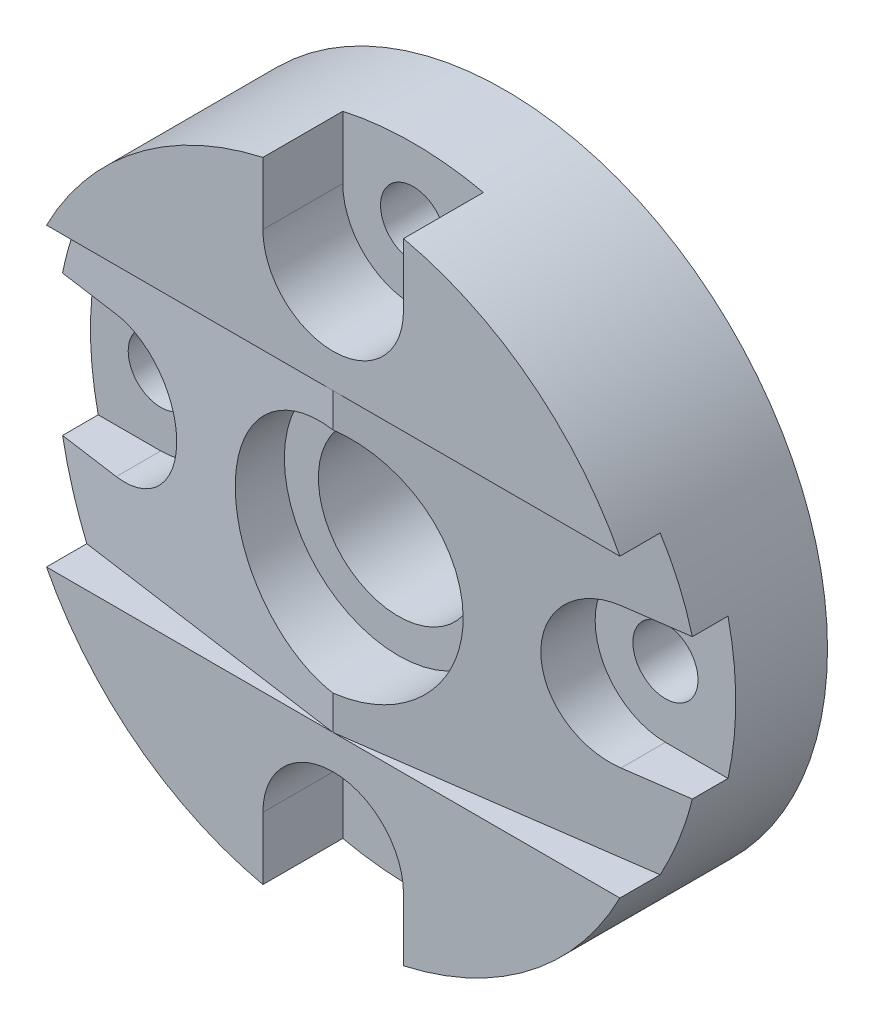
ISO-10303-21;
HEADER;
FILE_DESCRIPTION(('STEP AP214'),'2;1');
FILE_NAME('part.step','',(''),(''),'','','');
FILE_SCHEMA(('AUTOMOTIVE_DESIGN { 1 0 10303 214 1 1 1 1 }'));
ENDSEC;
DATA;
#1=APPLICATION_CONTEXT('core data for automotive mechanical design processes');
#2=APPLICATION_PROTOCOL_DEFINITION('international standard','automotive_design',2000,#1);
#3=PRODUCT_CONTEXT('',#1,'mechanical');
#4=PRODUCT('Part','Part','',(#3));
#5=PRODUCT_RELATED_PRODUCT_CATEGORY('part','',(#4));
#6=PRODUCT_DEFINITION_FORMATION('','',#4);
#7=PRODUCT_DEFINITION_CONTEXT('part definition',#1,'design');
#8=PRODUCT_DEFINITION('design','',#6,#7);
#9=PRODUCT_DEFINITION_SHAPE('','',#8);
#10=(LENGTH_UNIT() NAMED_UNIT(*) SI_UNIT(.MILLI.,.METRE.));
#11=(NAMED_UNIT(*) PLANE_ANGLE_UNIT() SI_UNIT($,.RADIAN.));
#12=(NAMED_UNIT(*) SI_UNIT($,.STERADIAN.) SOLID_ANGLE_UNIT());
#13=UNCERTAINTY_MEASURE_WITH_UNIT(LENGTH_MEASURE(1.E-05),#10,'distance_accuracy_value','');
#14=(GEOMETRIC_REPRESENTATION_CONTEXT(3) GLOBAL_UNCERTAINTY_ASSIGNED_CONTEXT((#13)) GLOBAL_UNIT_ASSIGNED_CONTEXT((#10,
#11,#12)) REPRESENTATION_CONTEXT('',''));
#15=CARTESIAN_POINT('',(0.,0.,0.));
#16=DIRECTION('',(0.,0.,1.));
#17=DIRECTION('',(1.,0.,0.));
#18=AXIS2_PLACEMENT_3D('',#15,#16,#17);
#19=CARTESIAN_POINT('',(0.,0.,0.));
#20=DIRECTION('',(0.,0.,1.));
#21=DIRECTION('',(1.,0.,0.));
#22=AXIS2_PLACEMENT_3D('',#19,#20,#21);
#23=PLANE('',#22);
#24=CARTESIAN_POINT('',(-3.02411339839128E-13,-43.307,0.));
#25=DIRECTION('',(0.,0.,1.));
#26=DIRECTION('',(-1.,0.,0.));
#27=AXIS2_PLACEMENT_3D('',#24,#25,#26);
#28=CIRCLE('',#27,5.588);
#29=CARTESIAN_POINT('',(-5.5880000000003,-43.307,0.));
#30=VERTEX_POINT('',#29);
#31=EDGE_CURVE('E381',#30,#30,#28,.T.);
#32=ORIENTED_EDGE('',*,*,#31,.T.);
#33=EDGE_LOOP('',(#32));
#34=FACE_BOUND('',#33,.T.);
#35=CARTESIAN_POINT('',(0.,43.307,0.));
#36=DIRECTION('',(0.,0.,1.));
#37=DIRECTION('',(1.,0.,0.));
#38=AXIS2_PLACEMENT_3D('',#35,#36,#37);
#39=CIRCLE('',#38,5.588);
#40=CARTESIAN_POINT('',(5.588,43.307,0.));
#41=VERTEX_POINT('',#40);
#42=EDGE_CURVE('E257',#41,#41,#39,.T.);
#43=ORIENTED_EDGE('',*,*,#42,.T.);
#44=EDGE_LOOP('',(#43));
#45=FACE_BOUND('',#44,.T.);
#46=CARTESIAN_POINT('',(0.,0.,0.));
#47=DIRECTION('',(0.,0.,1.));
#48=DIRECTION('',(1.,0.,0.));
#49=AXIS2_PLACEMENT_3D('',#46,#47,#48);
#50=CIRCLE('',#49,13.716);
#51=CARTESIAN_POINT('',(13.716,0.,0.));
#52=VERTEX_POINT('',#51);
#53=EDGE_CURVE('E340',#52,#52,#50,.T.);
#54=ORIENTED_EDGE('',*,*,#53,.T.);
#55=EDGE_LOOP('',(#54));
#56=FACE_BOUND('',#55,.T.);
#57=CARTESIAN_POINT('',(0.,0.,0.));
#58=DIRECTION('',(0.,0.,1.));
#59=DIRECTION('',(1.,0.,0.));
#60=AXIS2_PLACEMENT_3D('',#57,#58,#59);
#61=CIRCLE('',#60,55.372);
#62=CARTESIAN_POINT('',(55.372,0.,0.));
#63=VERTEX_POINT('',#62);
#64=EDGE_CURVE('E343',#63,#63,#61,.T.);
#65=ORIENTED_EDGE('',*,*,#64,.F.);
#66=EDGE_LOOP('',(#65));
#67=FACE_BOUND('',#66,.T.);
#68=CARTESIAN_POINT('',(43.307,-1.51205669919564E-13,0.));
#69=DIRECTION('',(0.,0.,1.));
#70=DIRECTION('',(0.,-1.,0.));
#71=AXIS2_PLACEMENT_3D('',#68,#69,#70);
#72=CIRCLE('',#71,5.588);
#73=CARTESIAN_POINT('',(43.307,-5.58800000000015,0.));
#74=VERTEX_POINT('',#73);
#75=EDGE_CURVE('E207',#74,#74,#72,.T.);
#76=ORIENTED_EDGE('',*,*,#75,.T.);
#77=EDGE_LOOP('',(#76));
#78=FACE_BOUND('',#77,.T.);
#79=CARTESIAN_POINT('',(-43.307,4.53617009758692E-13,0.));
#80=DIRECTION('',(0.,0.,1.));
#81=DIRECTION('',(0.,1.,0.));
#82=AXIS2_PLACEMENT_3D('',#79,#80,#81);
#83=CIRCLE('',#82,5.588);
#84=CARTESIAN_POINT('',(-43.3069999999999,5.58800000000045,0.));
#85=VERTEX_POINT('',#84);
#86=EDGE_CURVE('E389',#85,#85,#83,.T.);
#87=ORIENTED_EDGE('',*,*,#86,.T.);
#88=EDGE_LOOP('',(#87));
#89=FACE_BOUND('',#88,.T.);
#90=ADVANCED_FACE('F31',(#34,#45,#56,#67,#78,#89),#23,.F.);
#91=CARTESIAN_POINT('',(-43.307,4.53617009758692E-13,15.748));
#92=DIRECTION('',(0.,0.,-1.));
#93=DIRECTION('',(0.,-1.,0.));
#94=AXIS2_PLACEMENT_3D('',#91,#92,#93);
#95=PLANE('',#94);
#96=DIRECTION('',(-1.,0.,0.));
#97=VECTOR('',#96,1.);
#98=CARTESIAN_POINT('',(-43.3070000000001,-12.0649999999995,15.748));
#99=LINE('',#98,#97);
#100=CARTESIAN_POINT('',(-43.3070000000001,-12.0649999999995,15.748));
#101=VERTEX_POINT('',#100);
#102=CARTESIAN_POINT('',(-54.041596562278,-12.0649999999994,15.748));
#103=VERTEX_POINT('',#102);
#104=EDGE_CURVE('E186',#101,#103,#99,.T.);
#105=ORIENTED_EDGE('',*,*,#104,.F.);
#106=CARTESIAN_POINT('',(-43.307,4.53617009758692E-13,15.748));
#107=DIRECTION('',(0.,0.,-1.));
#108=DIRECTION('',(0.,-1.,0.));
#109=AXIS2_PLACEMENT_3D('',#106,#107,#108);
#110=CIRCLE('',#109,12.065);
#111=CARTESIAN_POINT('',(-43.3069999999999,12.0650000000005,15.748));
#112=VERTEX_POINT('',#111);
#113=EDGE_CURVE('E199',#112,#101,#110,.T.);
#114=ORIENTED_EDGE('',*,*,#113,.F.);
#115=DIRECTION('',(-1.,0.,0.));
#116=VECTOR('',#115,1.);
#117=CARTESIAN_POINT('',(-43.3069999999999,12.0650000000005,15.748));
#118=LINE('',#117,#116);
#119=CARTESIAN_POINT('',(-54.0415965622777,12.0650000000006,15.748));
#120=VERTEX_POINT('',#119);
#121=EDGE_CURVE('E192',#112,#120,#118,.T.);
#122=ORIENTED_EDGE('',*,*,#121,.T.);
#123=CARTESIAN_POINT('',(0.,0.,15.748));
#124=DIRECTION('',(0.,0.,-1.));
#125=DIRECTION('',(-1.,0.,0.));
#126=AXIS2_PLACEMENT_3D('',#123,#124,#125);
#127=CIRCLE('',#126,55.372);
#128=EDGE_CURVE('E11',#103,#120,#127,.T.);
#129=ORIENTED_EDGE('',*,*,#128,.F.);
#130=EDGE_LOOP('',(#105,#114,#122,#129));
#131=FACE_BOUND('',#130,.T.);
#132=CARTESIAN_POINT('',(-43.307,4.53617009758692E-13,15.748));
#133=DIRECTION('',(0.,0.,-1.));
#134=DIRECTION('',(-1.,0.,0.));
#135=AXIS2_PLACEMENT_3D('',#132,#133,#134);
#136=CIRCLE('',#135,5.588);
#137=CARTESIAN_POINT('',(-48.895,4.53617009758692E-13,15.748));
#138=VERTEX_POINT('',#137);
#139=EDGE_CURVE('E35',#138,#138,#136,.F.);
#140=ORIENTED_EDGE('',*,*,#139,.F.);
#141=EDGE_LOOP('',(#140));
#142=FACE_BOUND('',#141,.T.);
#143=ADVANCED_FACE('F196',(#131,#142),#95,.F.);
#144=CARTESIAN_POINT('',(-3.02411339839128E-13,-43.307,15.748));
#145=DIRECTION('',(0.,0.,-1.));
#146=DIRECTION('',(1.,0.,0.));
#147=AXIS2_PLACEMENT_3D('',#144,#145,#146);
#148=PLANE('',#147);
#149=DIRECTION('',(0.,-1.,0.));
#150=VECTOR('',#149,1.);
#151=CARTESIAN_POINT('',(12.0649999999997,-43.3070000000001,15.748));
#152=LINE('',#151,#150);
#153=CARTESIAN_POINT('',(12.0649999999997,-43.3070000000001,15.748));
#154=VERTEX_POINT('',#153);
#155=CARTESIAN_POINT('',(12.0649999999996,-54.0415965622779,15.748));
#156=VERTEX_POINT('',#155);
#157=EDGE_CURVE('E220',#154,#156,#152,.T.);
#158=ORIENTED_EDGE('',*,*,#157,.F.);
#159=CARTESIAN_POINT('',(-3.02411339839128E-13,-43.307,15.748));
#160=DIRECTION('',(0.,0.,-1.));
#161=DIRECTION('',(1.,0.,0.));
#162=AXIS2_PLACEMENT_3D('',#159,#160,#161);
#163=CIRCLE('',#162,12.065);
#164=CARTESIAN_POINT('',(-12.0650000000003,-43.3069999999999,15.748));
#165=VERTEX_POINT('',#164);
#166=EDGE_CURVE('E217',#165,#154,#163,.T.);
#167=ORIENTED_EDGE('',*,*,#166,.F.);
#168=DIRECTION('',(0.,-1.,0.));
#169=VECTOR('',#168,1.);
#170=CARTESIAN_POINT('',(-12.0650000000003,-43.3069999999999,15.748));
#171=LINE('',#170,#169);
#172=CARTESIAN_POINT('',(-12.0650000000004,-54.0415965622778,15.748));
#173=VERTEX_POINT('',#172);
#174=EDGE_CURVE('E222',#165,#173,#171,.T.);
#175=ORIENTED_EDGE('',*,*,#174,.T.);
#176=CARTESIAN_POINT('',(0.,0.,15.748));
#177=DIRECTION('',(0.,0.,-1.));
#178=DIRECTION('',(-1.,0.,0.));
#179=AXIS2_PLACEMENT_3D('',#176,#177,#178);
#180=CIRCLE('',#179,55.372);
#181=EDGE_CURVE('E372',#156,#173,#180,.T.);
#182=ORIENTED_EDGE('',*,*,#181,.F.);
#183=EDGE_LOOP('',(#158,#167,#175,#182));
#184=FACE_BOUND('',#183,.T.);
#185=CARTESIAN_POINT('',(-3.02411339839128E-13,-43.307,15.748));
#186=DIRECTION('',(0.,0.,-1.));
#187=DIRECTION('',(-1.,0.,0.));
#188=AXIS2_PLACEMENT_3D('',#185,#186,#187);
#189=CIRCLE('',#188,5.588);
#190=CARTESIAN_POINT('',(-5.5880000000003,-43.307,15.748));
#191=VERTEX_POINT('',#190);
#192=EDGE_CURVE('E379',#191,#191,#189,.F.);
#193=ORIENTED_EDGE('',*,*,#192,.F.);
#194=EDGE_LOOP('',(#193));
#195=FACE_BOUND('',#194,.T.);
#196=ADVANCED_FACE('F402',(#184,#195),#148,.F.);
#197=CARTESIAN_POINT('',(43.307,-1.51205669919564E-13,15.748));
#198=DIRECTION('',(0.,0.,-1.));
#199=DIRECTION('',(0.,1.,0.));
#200=AXIS2_PLACEMENT_3D('',#197,#198,#199);
#201=PLANE('',#200);
#202=DIRECTION('',(1.,0.,0.));
#203=VECTOR('',#202,1.);
#204=CARTESIAN_POINT('',(43.307,12.0649999999998,15.748));
#205=LINE('',#204,#203);
#206=CARTESIAN_POINT('',(43.307,12.0649999999998,15.748));
#207=VERTEX_POINT('',#206);
#208=CARTESIAN_POINT('',(54.0415965622779,12.0649999999998,15.748));
#209=VERTEX_POINT('',#208);
#210=EDGE_CURVE('E242',#207,#209,#205,.T.);
#211=ORIENTED_EDGE('',*,*,#210,.F.);
#212=CARTESIAN_POINT('',(43.307,-1.51205669919564E-13,15.748));
#213=DIRECTION('',(0.,0.,-1.));
#214=DIRECTION('',(0.,1.,0.));
#215=AXIS2_PLACEMENT_3D('',#212,#213,#214);
#216=CIRCLE('',#215,12.065);
#217=CARTESIAN_POINT('',(43.307,-12.0650000000002,15.748));
#218=VERTEX_POINT('',#217);
#219=EDGE_CURVE('E239',#218,#207,#216,.T.);
#220=ORIENTED_EDGE('',*,*,#219,.F.);
#221=DIRECTION('',(1.,0.,0.));
#222=VECTOR('',#221,1.);
#223=CARTESIAN_POINT('',(43.307,-12.0650000000002,15.748));
#224=LINE('',#223,#222);
#225=CARTESIAN_POINT('',(54.0415965622778,-12.0650000000002,15.748));
#226=VERTEX_POINT('',#225);
#227=EDGE_CURVE('E245',#218,#226,#224,.T.);
#228=ORIENTED_EDGE('',*,*,#227,.T.);
#229=CARTESIAN_POINT('',(0.,0.,15.748));
#230=DIRECTION('',(0.,0.,-1.));
#231=DIRECTION('',(-1.,0.,0.));
#232=AXIS2_PLACEMENT_3D('',#229,#230,#231);
#233=CIRCLE('',#232,55.372);
#234=EDGE_CURVE('E369',#209,#226,#233,.T.);
#235=ORIENTED_EDGE('',*,*,#234,.F.);
#236=EDGE_LOOP('',(#211,#220,#228,#235));
#237=FACE_BOUND('',#236,.T.);
#238=CARTESIAN_POINT('',(43.307,-1.51205669919564E-13,15.748));
#239=DIRECTION('',(0.,0.,-1.));
#240=DIRECTION('',(-1.,0.,0.));
#241=AXIS2_PLACEMENT_3D('',#238,#239,#240);
#242=CIRCLE('',#241,5.588);
#243=CARTESIAN_POINT('',(37.719,-1.51205669919564E-13,15.748));
#244=VERTEX_POINT('',#243);
#245=EDGE_CURVE('E204',#244,#244,#242,.F.);
#246=ORIENTED_EDGE('',*,*,#245,.F.);
#247=EDGE_LOOP('',(#246));
#248=FACE_BOUND('',#247,.T.);
#249=ADVANCED_FACE('F408',(#237,#248),#201,.F.);
#250=CARTESIAN_POINT('',(0.,0.,29.464));
#251=DIRECTION('',(0.,0.,-1.));
#252=DIRECTION('',(-1.,0.,0.));
#253=AXIS2_PLACEMENT_3D('',#250,#251,#252);
#254=CYLINDRICAL_SURFACE('',#253,55.372);
#255=ORIENTED_EDGE('',*,*,#64,.T.);
#256=EDGE_LOOP('',(#255));
#257=FACE_BOUND('',#256,.T.);
#258=DIRECTION('',(0.,0.,-1.));
#259=VECTOR('',#258,1.);
#260=CARTESIAN_POINT('',(-54.0415965622777,12.0650000000006,29.464));
#261=LINE('',#260,#259);
#262=CARTESIAN_POINT('',(-54.0415965622777,12.0650000000006,21.8689489104876));
#263=VERTEX_POINT('',#262);
#264=EDGE_CURVE('E215',#263,#120,#261,.T.);
#265=ORIENTED_EDGE('',*,*,#264,.F.);
#266=CARTESIAN_POINT('',(0.,0.,29.464));
#267=DIRECTION('',(-0.139173100960066,0.,0.99026806874157));
#268=DIRECTION('',(-0.99026806874157,0.,-0.139173100960066));
#269=AXIS2_PLACEMENT_3D('',#266,#267,#268);
#270=ELLIPSE('',#269,55.9161723455009,55.372);
#271=CARTESIAN_POINT('',(-49.20262578359,25.4,22.5490219028248));
#272=VERTEX_POINT('',#271);
#273=EDGE_CURVE('E299',#272,#263,#270,.T.);
#274=ORIENTED_EDGE('',*,*,#273,.F.);
#275=DIRECTION('',(0.,0.,-1.));
#276=VECTOR('',#275,1.);
#277=CARTESIAN_POINT('',(-49.2026257835901,25.4,29.464));
#278=LINE('',#277,#276);
#279=CARTESIAN_POINT('',(-49.2026257835901,25.4,29.464));
#280=VERTEX_POINT('',#279);
#281=EDGE_CURVE('E304',#272,#280,#278,.F.);
#282=ORIENTED_EDGE('',*,*,#281,.T.);
#283=CARTESIAN_POINT('',(0.,0.,29.464));
#284=DIRECTION('',(0.,0.,1.));
#285=DIRECTION('',(1.,0.,0.));
#286=AXIS2_PLACEMENT_3D('',#283,#284,#285);
#287=CIRCLE('',#286,55.372);
#288=CARTESIAN_POINT('',(-12.065,54.0415965622778,29.464));
#289=VERTEX_POINT('',#288);
#290=EDGE_CURVE('E351',#289,#280,#287,.T.);
#291=ORIENTED_EDGE('',*,*,#290,.F.);
#292=DIRECTION('',(0.,0.,-1.));
#293=VECTOR('',#292,1.);
#294=CARTESIAN_POINT('',(-12.065,54.0415965622778,29.464));
#295=LINE('',#294,#293);
#296=CARTESIAN_POINT('',(-12.065,54.0415965622778,15.748));
#297=VERTEX_POINT('',#296);
#298=EDGE_CURVE('E281',#289,#297,#295,.T.);
#299=ORIENTED_EDGE('',*,*,#298,.T.);
#300=CARTESIAN_POINT('',(0.,0.,15.748));
#301=DIRECTION('',(0.,0.,-1.));
#302=DIRECTION('',(-1.,0.,0.));
#303=AXIS2_PLACEMENT_3D('',#300,#301,#302);
#304=CIRCLE('',#303,55.372);
#305=CARTESIAN_POINT('',(12.065,54.0415965622778,15.748));
#306=VERTEX_POINT('',#305);
#307=EDGE_CURVE('E357',#297,#306,#304,.T.);
#308=ORIENTED_EDGE('',*,*,#307,.T.);
#309=DIRECTION('',(0.,0.,-1.));
#310=VECTOR('',#309,1.);
#311=CARTESIAN_POINT('',(12.065,54.0415965622778,29.464));
#312=LINE('',#311,#310);
#313=CARTESIAN_POINT('',(12.065,54.0415965622778,29.464));
#314=VERTEX_POINT('',#313);
#315=EDGE_CURVE('E285',#314,#306,#312,.T.);
#316=ORIENTED_EDGE('',*,*,#315,.F.);
#317=CARTESIAN_POINT('',(49.2026257835901,25.4,29.464));
#318=VERTEX_POINT('',#317);
#319=EDGE_CURVE('E347',#318,#314,#287,.T.);
#320=ORIENTED_EDGE('',*,*,#319,.F.);
#321=DIRECTION('',(0.,0.,-1.));
#322=VECTOR('',#321,1.);
#323=CARTESIAN_POINT('',(49.2026257835901,25.4,29.464));
#324=LINE('',#323,#322);
#325=CARTESIAN_POINT('',(49.20262578359,25.4,22.5490219028248));
#326=VERTEX_POINT('',#325);
#327=EDGE_CURVE('E330',#318,#326,#324,.T.);
#328=ORIENTED_EDGE('',*,*,#327,.T.);
#329=CARTESIAN_POINT('',(0.,0.,29.464));
#330=DIRECTION('',(0.139173100960066,0.,0.99026806874157));
#331=DIRECTION('',(0.99026806874157,0.,-0.139173100960066));
#332=AXIS2_PLACEMENT_3D('',#329,#330,#331);
#333=ELLIPSE('',#332,55.9161723455009,55.372);
#334=CARTESIAN_POINT('',(54.0415965622779,12.0649999999998,21.8689489104876));
#335=VERTEX_POINT('',#334);
#336=EDGE_CURVE('E326',#335,#326,#333,.T.);
#337=ORIENTED_EDGE('',*,*,#336,.F.);
#338=DIRECTION('',(0.,0.,-1.));
#339=VECTOR('',#338,1.);
#340=CARTESIAN_POINT('',(54.0415965622779,12.0649999999998,29.464));
#341=LINE('',#340,#339);
#342=EDGE_CURVE('E251',#335,#209,#341,.T.);
#343=ORIENTED_EDGE('',*,*,#342,.T.);
#344=ORIENTED_EDGE('',*,*,#234,.T.);
#345=DIRECTION('',(0.,0.,-1.));
#346=VECTOR('',#345,1.);
#347=CARTESIAN_POINT('',(54.0415965622778,-12.0650000000002,29.464));
#348=LINE('',#347,#346);
#349=CARTESIAN_POINT('',(54.0415965622778,-12.0650000000002,21.8689489104876));
#350=VERTEX_POINT('',#349);
#351=EDGE_CURVE('E255',#350,#226,#348,.T.);
#352=ORIENTED_EDGE('',*,*,#351,.F.);
#353=CARTESIAN_POINT('',(49.20262578359,-25.4,22.5490219028248));
#354=VERTEX_POINT('',#353);
#355=EDGE_CURVE('E327',#354,#350,#333,.T.);
#356=ORIENTED_EDGE('',*,*,#355,.F.);
#357=DIRECTION('',(0.,0.,-1.));
#358=VECTOR('',#357,1.);
#359=CARTESIAN_POINT('',(49.2026257835901,-25.4,29.464));
#360=LINE('',#359,#358);
#361=CARTESIAN_POINT('',(49.2026257835901,-25.4,29.464));
#362=VERTEX_POINT('',#361);
#363=EDGE_CURVE('E333',#354,#362,#360,.F.);
#364=ORIENTED_EDGE('',*,*,#363,.T.);
#365=CARTESIAN_POINT('',(12.0649999999996,-54.0415965622779,29.464));
#366=VERTEX_POINT('',#365);
#367=EDGE_CURVE('E346',#366,#362,#287,.T.);
#368=ORIENTED_EDGE('',*,*,#367,.F.);
#369=DIRECTION('',(0.,0.,-1.));
#370=VECTOR('',#369,1.);
#371=CARTESIAN_POINT('',(12.0649999999996,-54.0415965622779,29.464));
#372=LINE('',#371,#370);
#373=EDGE_CURVE('E56',#366,#156,#372,.T.);
#374=ORIENTED_EDGE('',*,*,#373,.T.);
#375=ORIENTED_EDGE('',*,*,#181,.T.);
#376=DIRECTION('',(0.,0.,-1.));
#377=VECTOR('',#376,1.);
#378=CARTESIAN_POINT('',(-12.0650000000004,-54.0415965622778,29.464));
#379=LINE('',#378,#377);
#380=CARTESIAN_POINT('',(-12.0650000000004,-54.0415965622778,29.464));
#381=VERTEX_POINT('',#380);
#382=EDGE_CURVE('E237',#381,#173,#379,.T.);
#383=ORIENTED_EDGE('',*,*,#382,.F.);
#384=CARTESIAN_POINT('',(-49.2026257835901,-25.4,29.464));
#385=VERTEX_POINT('',#384);
#386=EDGE_CURVE('E352',#385,#381,#287,.T.);
#387=ORIENTED_EDGE('',*,*,#386,.F.);
#388=DIRECTION('',(0.,0.,-1.));
#389=VECTOR('',#388,1.);
#390=CARTESIAN_POINT('',(-49.2026257835901,-25.4,29.464));
#391=LINE('',#390,#389);
#392=CARTESIAN_POINT('',(-49.20262578359,-25.4,22.5490219028248));
#393=VERTEX_POINT('',#392);
#394=EDGE_CURVE('E307',#385,#393,#391,.T.);
#395=ORIENTED_EDGE('',*,*,#394,.T.);
#396=CARTESIAN_POINT('',(-54.041596562278,-12.0649999999994,21.8689489104875));
#397=VERTEX_POINT('',#396);
#398=EDGE_CURVE('E298',#397,#393,#270,.T.);
#399=ORIENTED_EDGE('',*,*,#398,.F.);
#400=DIRECTION('',(0.,0.,-1.));
#401=VECTOR('',#400,1.);
#402=CARTESIAN_POINT('',(-54.041596562278,-12.0649999999994,29.464));
#403=LINE('',#402,#401);
#404=EDGE_CURVE('E48',#397,#103,#403,.T.);
#405=ORIENTED_EDGE('',*,*,#404,.T.);
#406=ORIENTED_EDGE('',*,*,#128,.T.);
#407=EDGE_LOOP('',(#265,#274,#282,#291,#299,#308,#316,#320,#328,#337,#343,#344,#352,#356,#364,
#368,#374,#375,#383,#387,#395,#399,#405,#406));
#408=FACE_BOUND('',#407,.T.);
#409=ADVANCED_FACE('F33',(#257,#408),#254,.T.);
#410=CARTESIAN_POINT('',(0.,-25.4,29.464));
#411=DIRECTION('',(-0.139173100960066,0.,0.99026806874157));
#412=DIRECTION('',(-0.99026806874157,0.,-0.139173100960066));
#413=AXIS2_PLACEMENT_3D('',#410,#411,#412);
#414=PLANE('',#413);
#415=ORIENTED_EDGE('',*,*,#273,.T.);
#416=DIRECTION('',(0.99026806874157,0.,0.139173100960066));
#417=VECTOR('',#416,1.);
#418=CARTESIAN_POINT('',(3.84824327610574E-13,12.065,29.4640000000001));
#419=LINE('',#418,#417);
#420=CARTESIAN_POINT('',(-43.3069999999999,12.0650000000005,23.3775980715435));
#421=VERTEX_POINT('',#420);
#422=EDGE_CURVE('E40',#263,#421,#419,.T.);
#423=ORIENTED_EDGE('',*,*,#422,.T.);
#424=CARTESIAN_POINT('',(-43.307,4.53617009758692E-13,23.3775980715435));
#425=DIRECTION('',(-0.139173100960066,0.,0.99026806874157));
#426=DIRECTION('',(-0.99026806874157,0.,-0.139173100960066));
#427=AXIS2_PLACEMENT_3D('',#424,#425,#426);
#428=ELLIPSE('',#427,12.1835696624371,12.065);
#429=CARTESIAN_POINT('',(-43.3070000000001,-12.0649999999995,23.3775980715435));
#430=VERTEX_POINT('',#429);
#431=EDGE_CURVE('E376',#430,#421,#428,.T.);
#432=ORIENTED_EDGE('',*,*,#431,.F.);
#433=DIRECTION('',(0.99026806874157,0.,0.139173100960066));
#434=VECTOR('',#433,1.);
#435=CARTESIAN_POINT('',(1.36971370844442E-13,-12.065,29.464));
#436=LINE('',#435,#434);
#437=EDGE_CURVE('E187',#397,#430,#436,.T.);
#438=ORIENTED_EDGE('',*,*,#437,.F.);
#439=ORIENTED_EDGE('',*,*,#398,.T.);
#440=DIRECTION('',(-0.99026806874157,0.,-0.139173100960066));
#441=VECTOR('',#440,1.);
#442=CARTESIAN_POINT('',(0.,-25.4,29.464));
#443=LINE('',#442,#441);
#444=CARTESIAN_POINT('',(0.,-25.4,29.464));
#445=VERTEX_POINT('',#444);
#446=EDGE_CURVE('E293',#445,#393,#443,.T.);
#447=ORIENTED_EDGE('',*,*,#446,.F.);
#448=DIRECTION('',(0.,-1.,0.));
#449=VECTOR('',#448,1.);
#450=CARTESIAN_POINT('',(0.,25.4,29.464));
#451=LINE('',#450,#449);
#452=CARTESIAN_POINT('',(0.,-19.558,29.464));
#453=VERTEX_POINT('',#452);
#454=EDGE_CURVE('E316',#453,#445,#451,.T.);
#455=ORIENTED_EDGE('',*,*,#454,.F.);
#456=CARTESIAN_POINT('',(0.,0.,29.464));
#457=DIRECTION('',(-0.139173100960066,0.,0.99026806874157));
#458=DIRECTION('',(0.99026806874157,0.,0.139173100960066));
#459=AXIS2_PLACEMENT_3D('',#456,#457,#458);
#460=ELLIPSE('',#459,19.7502076633191,19.558);
#461=CARTESIAN_POINT('',(0.,19.558,29.464));
#462=VERTEX_POINT('',#461);
#463=EDGE_CURVE('E302',#453,#462,#460,.F.);
#464=ORIENTED_EDGE('',*,*,#463,.T.);
#465=CARTESIAN_POINT('',(0.,25.4,29.464));
#466=VERTEX_POINT('',#465);
#467=EDGE_CURVE('E317',#466,#462,#451,.T.);
#468=ORIENTED_EDGE('',*,*,#467,.F.);
#469=DIRECTION('',(0.99026806874157,0.,0.139173100960066));
#470=VECTOR('',#469,1.);
#471=CARTESIAN_POINT('',(0.,25.4,29.464));
#472=LINE('',#471,#470);
#473=EDGE_CURVE('E296',#272,#466,#472,.T.);
#474=ORIENTED_EDGE('',*,*,#473,.F.);
#475=EDGE_LOOP('',(#415,#423,#432,#438,#439,#447,#455,#464,#468,#474));
#476=FACE_BOUND('',#475,.T.);
#477=ADVANCED_FACE('F473',(#476),#414,.T.);
#478=CARTESIAN_POINT('',(0.,0.,29.464));
#479=DIRECTION('',(0.,0.,1.));
#480=DIRECTION('',(1.,0.,0.));
#481=AXIS2_PLACEMENT_3D('',#478,#479,#480);
#482=PLANE('',#481);
#483=ORIENTED_EDGE('',*,*,#386,.T.);
#484=DIRECTION('',(0.,-1.,0.));
#485=VECTOR('',#484,1.);
#486=CARTESIAN_POINT('',(-12.0650000000003,-43.3069999999999,29.464));
#487=LINE('',#486,#485);
#488=CARTESIAN_POINT('',(-12.0650000000003,-43.3069999999999,29.464));
#489=VERTEX_POINT('',#488);
#490=EDGE_CURVE('E230',#489,#381,#487,.T.);
#491=ORIENTED_EDGE('',*,*,#490,.F.);
#492=CARTESIAN_POINT('',(-3.02411339839128E-13,-43.307,29.464));
#493=DIRECTION('',(0.,0.,-1.));
#494=DIRECTION('',(1.,0.,0.));
#495=AXIS2_PLACEMENT_3D('',#492,#493,#494);
#496=CIRCLE('',#495,12.065);
#497=CARTESIAN_POINT('',(12.0649999999997,-43.3070000000001,29.464));
#498=VERTEX_POINT('',#497);
#499=EDGE_CURVE('E225',#489,#498,#496,.T.);
#500=ORIENTED_EDGE('',*,*,#499,.T.);
#501=DIRECTION('',(0.,-1.,0.));
#502=VECTOR('',#501,1.);
#503=CARTESIAN_POINT('',(12.0649999999997,-43.3070000000001,29.464));
#504=LINE('',#503,#502);
#505=EDGE_CURVE('E228',#498,#366,#504,.T.);
#506=ORIENTED_EDGE('',*,*,#505,.T.);
#507=ORIENTED_EDGE('',*,*,#367,.T.);
#508=DIRECTION('',(1.,0.,0.));
#509=VECTOR('',#508,1.);
#510=CARTESIAN_POINT('',(0.,-25.4,29.464));
#511=LINE('',#510,#509);
#512=EDGE_CURVE('E310',#445,#362,#511,.T.);
#513=ORIENTED_EDGE('',*,*,#512,.F.);
#514=DIRECTION('',(-1.,0.,0.));
#515=VECTOR('',#514,1.);
#516=CARTESIAN_POINT('',(0.,-25.4,29.464));
#517=LINE('',#516,#515);
#518=EDGE_CURVE('E287',#445,#385,#517,.T.);
#519=ORIENTED_EDGE('',*,*,#518,.T.);
#520=EDGE_LOOP('',(#483,#491,#500,#506,#507,#513,#519));
#521=FACE_BOUND('',#520,.T.);
#522=ADVANCED_FACE('F476',(#521),#482,.T.);
#523=CARTESIAN_POINT('',(0.,-25.4,29.464));
#524=DIRECTION('',(0.139173100960066,0.,0.99026806874157));
#525=DIRECTION('',(0.99026806874157,0.,-0.139173100960066));
#526=AXIS2_PLACEMENT_3D('',#523,#524,#525);
#527=PLANE('',#526);
#528=ORIENTED_EDGE('',*,*,#355,.T.);
#529=DIRECTION('',(-0.99026806874157,0.,0.139173100960066));
#530=VECTOR('',#529,1.);
#531=CARTESIAN_POINT('',(0.,-12.065,29.464));
#532=LINE('',#531,#530);
#533=CARTESIAN_POINT('',(43.307,-12.0650000000002,23.3775980715435));
#534=VERTEX_POINT('',#533);
#535=EDGE_CURVE('E366',#350,#534,#532,.T.);
#536=ORIENTED_EDGE('',*,*,#535,.T.);
#537=CARTESIAN_POINT('',(43.307,-1.51205669919564E-13,23.3775980715435));
#538=DIRECTION('',(0.139173100960066,0.,0.99026806874157));
#539=DIRECTION('',(0.99026806874157,0.,-0.139173100960066));
#540=AXIS2_PLACEMENT_3D('',#537,#538,#539);
#541=ELLIPSE('',#540,12.1835696624371,12.065);
#542=CARTESIAN_POINT('',(43.307,12.0649999999998,23.3775980715435));
#543=VERTEX_POINT('',#542);
#544=EDGE_CURVE('E364',#543,#534,#541,.T.);
#545=ORIENTED_EDGE('',*,*,#544,.F.);
#546=DIRECTION('',(-0.99026806874157,0.,0.139173100960066));
#547=VECTOR('',#546,1.);
#548=CARTESIAN_POINT('',(1.28274775870191E-13,12.065,29.464));
#549=LINE('',#548,#547);
#550=EDGE_CURVE('E360',#335,#543,#549,.T.);
#551=ORIENTED_EDGE('',*,*,#550,.F.);
#552=ORIENTED_EDGE('',*,*,#336,.T.);
#553=DIRECTION('',(-0.99026806874157,0.,0.139173100960066));
#554=VECTOR('',#553,1.);
#555=CARTESIAN_POINT('',(0.,25.4,29.464));
#556=LINE('',#555,#554);
#557=EDGE_CURVE('E323',#326,#466,#556,.T.);
#558=ORIENTED_EDGE('',*,*,#557,.T.);
#559=ORIENTED_EDGE('',*,*,#467,.T.);
#560=CARTESIAN_POINT('',(0.,0.,29.464));
#561=DIRECTION('',(0.139173100960066,0.,0.99026806874157));
#562=DIRECTION('',(-0.99026806874157,0.,0.139173100960066));
#563=AXIS2_PLACEMENT_3D('',#560,#561,#562);
#564=ELLIPSE('',#563,19.7502076633191,19.558);
#565=EDGE_CURVE('E350',#462,#453,#564,.F.);
#566=ORIENTED_EDGE('',*,*,#565,.T.);
#567=ORIENTED_EDGE('',*,*,#454,.T.);
#568=DIRECTION('',(0.99026806874157,0.,-0.139173100960066));
#569=VECTOR('',#568,1.);
#570=CARTESIAN_POINT('',(0.,-25.4,29.464));
#571=LINE('',#570,#569);
#572=EDGE_CURVE('E320',#445,#354,#571,.T.);
#573=ORIENTED_EDGE('',*,*,#572,.T.);
#574=EDGE_LOOP('',(#528,#536,#545,#551,#552,#558,#559,#566,#567,#573));
#575=FACE_BOUND('',#574,.T.);
#576=ADVANCED_FACE('F459',(#575),#527,.T.);
#577=CARTESIAN_POINT('',(0.,43.307,15.748));
#578=DIRECTION('',(0.,0.,-1.));
#579=DIRECTION('',(-1.,0.,0.));
#580=AXIS2_PLACEMENT_3D('',#577,#578,#579);
#581=PLANE('',#580);
#582=DIRECTION('',(0.,1.,0.));
#583=VECTOR('',#582,1.);
#584=CARTESIAN_POINT('',(-12.065,43.307,15.748));
#585=LINE('',#584,#583);
#586=CARTESIAN_POINT('',(-12.065,43.307,15.748));
#587=VERTEX_POINT('',#586);
#588=EDGE_CURVE('E264',#587,#297,#585,.T.);
#589=ORIENTED_EDGE('',*,*,#588,.F.);
#590=CARTESIAN_POINT('',(0.,43.307,15.748));
#591=DIRECTION('',(0.,0.,-1.));
#592=DIRECTION('',(-1.,0.,0.));
#593=AXIS2_PLACEMENT_3D('',#590,#591,#592);
#594=CIRCLE('',#593,12.065);
#595=CARTESIAN_POINT('',(12.065,43.307,15.748));
#596=VERTEX_POINT('',#595);
#597=EDGE_CURVE('E261',#596,#587,#594,.T.);
#598=ORIENTED_EDGE('',*,*,#597,.F.);
#599=DIRECTION('',(0.,1.,0.));
#600=VECTOR('',#599,1.);
#601=CARTESIAN_POINT('',(12.065,43.307,15.748));
#602=LINE('',#601,#600);
#603=EDGE_CURVE('E267',#596,#306,#602,.T.);
#604=ORIENTED_EDGE('',*,*,#603,.T.);
#605=ORIENTED_EDGE('',*,*,#307,.F.);
#606=EDGE_LOOP('',(#589,#598,#604,#605));
#607=FACE_BOUND('',#606,.T.);
#608=CARTESIAN_POINT('',(0.,43.307,15.748));
#609=DIRECTION('',(0.,0.,-1.));
#610=DIRECTION('',(-1.,0.,0.));
#611=AXIS2_PLACEMENT_3D('',#608,#609,#610);
#612=CIRCLE('',#611,5.588);
#613=CARTESIAN_POINT('',(-5.588,43.307,15.748));
#614=VERTEX_POINT('',#613);
#615=EDGE_CURVE('E260',#614,#614,#612,.F.);
#616=ORIENTED_EDGE('',*,*,#615,.F.);
#617=EDGE_LOOP('',(#616));
#618=FACE_BOUND('',#617,.T.);
#619=ADVANCED_FACE('F455',(#607,#618),#581,.F.);
#620=ORIENTED_EDGE('',*,*,#319,.T.);
#621=DIRECTION('',(0.,1.,0.));
#622=VECTOR('',#621,1.);
#623=CARTESIAN_POINT('',(12.065,43.307,29.464));
#624=LINE('',#623,#622);
#625=CARTESIAN_POINT('',(12.065,43.307,29.464));
#626=VERTEX_POINT('',#625);
#627=EDGE_CURVE('E276',#626,#314,#624,.T.);
#628=ORIENTED_EDGE('',*,*,#627,.F.);
#629=CARTESIAN_POINT('',(0.,43.307,29.464));
#630=DIRECTION('',(0.,0.,-1.));
#631=DIRECTION('',(-1.,0.,0.));
#632=AXIS2_PLACEMENT_3D('',#629,#630,#631);
#633=CIRCLE('',#632,12.065);
#634=CARTESIAN_POINT('',(-12.065,43.307,29.464));
#635=VERTEX_POINT('',#634);
#636=EDGE_CURVE('E270',#626,#635,#633,.T.);
#637=ORIENTED_EDGE('',*,*,#636,.T.);
#638=DIRECTION('',(0.,1.,0.));
#639=VECTOR('',#638,1.);
#640=CARTESIAN_POINT('',(-12.065,43.307,29.464));
#641=LINE('',#640,#639);
#642=EDGE_CURVE('E273',#635,#289,#641,.T.);
#643=ORIENTED_EDGE('',*,*,#642,.T.);
#644=ORIENTED_EDGE('',*,*,#290,.T.);
#645=DIRECTION('',(1.,0.,0.));
#646=VECTOR('',#645,1.);
#647=CARTESIAN_POINT('',(0.,25.4,29.464));
#648=LINE('',#647,#646);
#649=EDGE_CURVE('E290',#280,#466,#648,.T.);
#650=ORIENTED_EDGE('',*,*,#649,.T.);
#651=DIRECTION('',(-1.,0.,0.));
#652=VECTOR('',#651,1.);
#653=CARTESIAN_POINT('',(0.,25.4,29.464));
#654=LINE('',#653,#652);
#655=EDGE_CURVE('E313',#318,#466,#654,.T.);
#656=ORIENTED_EDGE('',*,*,#655,.F.);
#657=EDGE_LOOP('',(#620,#628,#637,#643,#644,#650,#656));
#658=FACE_BOUND('',#657,.T.);
#659=ADVANCED_FACE('F458',(#658),#482,.T.);
#660=CARTESIAN_POINT('',(0.,0.,18.288));
#661=DIRECTION('',(0.,0.,1.));
#662=DIRECTION('',(1.,0.,0.));
#663=AXIS2_PLACEMENT_3D('',#660,#661,#662);
#664=CYLINDRICAL_SURFACE('',#663,19.558);
#665=CARTESIAN_POINT('',(0.,0.,18.288));
#666=DIRECTION('',(0.,0.,1.));
#667=DIRECTION('',(1.,0.,0.));
#668=AXIS2_PLACEMENT_3D('',#665,#666,#667);
#669=CIRCLE('',#668,19.558);
#670=CARTESIAN_POINT('',(19.558,0.,18.288));
#671=VERTEX_POINT('',#670);
#672=EDGE_CURVE('E336',#671,#671,#669,.T.);
#673=ORIENTED_EDGE('',*,*,#672,.F.);
#674=EDGE_LOOP('',(#673));
#675=FACE_BOUND('',#674,.T.);
#676=ORIENTED_EDGE('',*,*,#463,.F.);
#677=ORIENTED_EDGE('',*,*,#565,.F.);
#678=EDGE_LOOP('',(#676,#677));
#679=FACE_BOUND('',#678,.T.);
#680=ADVANCED_FACE('F501',(#675,#679),#664,.F.);
#681=CARTESIAN_POINT('',(0.,0.,0.));
#682=DIRECTION('',(0.,0.,1.));
#683=DIRECTION('',(1.,0.,0.));
#684=AXIS2_PLACEMENT_3D('',#681,#682,#683);
#685=CYLINDRICAL_SURFACE('',#684,13.716);
#686=ORIENTED_EDGE('',*,*,#53,.F.);
#687=EDGE_LOOP('',(#686));
#688=FACE_BOUND('',#687,.T.);
#689=CARTESIAN_POINT('',(0.,0.,18.288));
#690=DIRECTION('',(0.,0.,1.));
#691=DIRECTION('',(1.,0.,0.));
#692=AXIS2_PLACEMENT_3D('',#689,#690,#691);
#693=CIRCLE('',#692,13.716);
#694=CARTESIAN_POINT('',(13.716,0.,18.288));
#695=VERTEX_POINT('',#694);
#696=EDGE_CURVE('E339',#695,#695,#693,.F.);
#697=ORIENTED_EDGE('',*,*,#696,.F.);
#698=EDGE_LOOP('',(#697));
#699=FACE_BOUND('',#698,.T.);
#700=ADVANCED_FACE('F499',(#688,#699),#685,.F.);
#701=CARTESIAN_POINT('',(0.,0.,18.288));
#702=DIRECTION('',(0.,0.,1.));
#703=DIRECTION('',(1.,0.,0.));
#704=AXIS2_PLACEMENT_3D('',#701,#702,#703);
#705=PLANE('',#704);
#706=ORIENTED_EDGE('',*,*,#672,.T.);
#707=EDGE_LOOP('',(#706));
#708=FACE_BOUND('',#707,.T.);
#709=ORIENTED_EDGE('',*,*,#696,.T.);
#710=EDGE_LOOP('',(#709));
#711=FACE_BOUND('',#710,.T.);
#712=ADVANCED_FACE('F495',(#708,#711),#705,.T.);
#713=CARTESIAN_POINT('',(0.,-25.4,29.464));
#714=DIRECTION('',(0.,-1.,0.));
#715=DIRECTION('',(0.,0.,-1.));
#716=AXIS2_PLACEMENT_3D('',#713,#714,#715);
#717=PLANE('',#716);
#718=ORIENTED_EDGE('',*,*,#572,.F.);
#719=ORIENTED_EDGE('',*,*,#512,.T.);
#720=ORIENTED_EDGE('',*,*,#363,.F.);
#721=EDGE_LOOP('',(#718,#719,#720));
#722=FACE_BOUND('',#721,.T.);
#723=ADVANCED_FACE('F491',(#722),#717,.F.);
#724=CARTESIAN_POINT('',(0.,25.4,29.464));
#725=DIRECTION('',(0.,1.,0.));
#726=DIRECTION('',(0.,0.,1.));
#727=AXIS2_PLACEMENT_3D('',#724,#725,#726);
#728=PLANE('',#727);
#729=ORIENTED_EDGE('',*,*,#655,.T.);
#730=ORIENTED_EDGE('',*,*,#557,.F.);
#731=ORIENTED_EDGE('',*,*,#327,.F.);
#732=EDGE_LOOP('',(#729,#730,#731));
#733=FACE_BOUND('',#732,.T.);
#734=ADVANCED_FACE('F484',(#733),#728,.F.);
#735=CARTESIAN_POINT('',(0.,-25.4,29.464));
#736=DIRECTION('',(0.,-1.,0.));
#737=DIRECTION('',(0.,0.,-1.));
#738=AXIS2_PLACEMENT_3D('',#735,#736,#737);
#739=PLANE('',#738);
#740=ORIENTED_EDGE('',*,*,#518,.F.);
#741=ORIENTED_EDGE('',*,*,#446,.T.);
#742=ORIENTED_EDGE('',*,*,#394,.F.);
#743=EDGE_LOOP('',(#740,#741,#742));
#744=FACE_BOUND('',#743,.T.);
#745=ADVANCED_FACE('F480',(#744),#739,.F.);
#746=CARTESIAN_POINT('',(0.,25.4,29.464));
#747=DIRECTION('',(0.,1.,0.));
#748=DIRECTION('',(0.,0.,1.));
#749=AXIS2_PLACEMENT_3D('',#746,#747,#748);
#750=PLANE('',#749);
#751=ORIENTED_EDGE('',*,*,#473,.T.);
#752=ORIENTED_EDGE('',*,*,#649,.F.);
#753=ORIENTED_EDGE('',*,*,#281,.F.);
#754=EDGE_LOOP('',(#751,#752,#753));
#755=FACE_BOUND('',#754,.T.);
#756=ADVANCED_FACE('F465',(#755),#750,.F.);
#757=CARTESIAN_POINT('',(12.065,43.307,29.464));
#758=DIRECTION('',(-1.,0.,0.));
#759=DIRECTION('',(0.,0.,1.));
#760=AXIS2_PLACEMENT_3D('',#757,#758,#759);
#761=PLANE('',#760);
#762=ORIENTED_EDGE('',*,*,#315,.T.);
#763=ORIENTED_EDGE('',*,*,#603,.F.);
#764=DIRECTION('',(0.,0.,-1.));
#765=VECTOR('',#764,1.);
#766=CARTESIAN_POINT('',(12.065,43.307,29.464));
#767=LINE('',#766,#765);
#768=EDGE_CURVE('E279',#626,#596,#767,.T.);
#769=ORIENTED_EDGE('',*,*,#768,.F.);
#770=ORIENTED_EDGE('',*,*,#627,.T.);
#771=EDGE_LOOP('',(#762,#763,#769,#770));
#772=FACE_BOUND('',#771,.T.);
#773=ADVANCED_FACE('F461',(#772),#761,.T.);
#774=CARTESIAN_POINT('',(-12.065,43.307,29.464));
#775=DIRECTION('',(-1.,0.,0.));
#776=DIRECTION('',(0.,0.,1.));
#777=AXIS2_PLACEMENT_3D('',#774,#775,#776);
#778=PLANE('',#777);
#779=ORIENTED_EDGE('',*,*,#642,.F.);
#780=DIRECTION('',(0.,0.,-1.));
#781=VECTOR('',#780,1.);
#782=CARTESIAN_POINT('',(-12.065,43.307,29.464));
#783=LINE('',#782,#781);
#784=EDGE_CURVE('E278',#635,#587,#783,.T.);
#785=ORIENTED_EDGE('',*,*,#784,.T.);
#786=ORIENTED_EDGE('',*,*,#588,.T.);
#787=ORIENTED_EDGE('',*,*,#298,.F.);
#788=EDGE_LOOP('',(#779,#785,#786,#787));
#789=FACE_BOUND('',#788,.T.);
#790=ADVANCED_FACE('F464',(#789),#778,.F.);
#791=CARTESIAN_POINT('',(0.,43.307,29.464));
#792=DIRECTION('',(0.,0.,-1.));
#793=DIRECTION('',(-1.,0.,0.));
#794=AXIS2_PLACEMENT_3D('',#791,#792,#793);
#795=CYLINDRICAL_SURFACE('',#794,12.065);
#796=ORIENTED_EDGE('',*,*,#597,.T.);
#797=ORIENTED_EDGE('',*,*,#784,.F.);
#798=ORIENTED_EDGE('',*,*,#636,.F.);
#799=ORIENTED_EDGE('',*,*,#768,.T.);
#800=EDGE_LOOP('',(#796,#797,#798,#799));
#801=FACE_BOUND('',#800,.T.);
#802=ADVANCED_FACE('F453',(#801),#795,.F.);
#803=CARTESIAN_POINT('',(0.,43.307,29.464));
#804=DIRECTION('',(0.,0.,-1.));
#805=DIRECTION('',(-1.,0.,0.));
#806=AXIS2_PLACEMENT_3D('',#803,#804,#805);
#807=CYLINDRICAL_SURFACE('',#806,5.588);
#808=ORIENTED_EDGE('',*,*,#42,.F.);
#809=EDGE_LOOP('',(#808));
#810=FACE_BOUND('',#809,.T.);
#811=ORIENTED_EDGE('',*,*,#615,.T.);
#812=EDGE_LOOP('',(#811));
#813=FACE_BOUND('',#812,.T.);
#814=ADVANCED_FACE('F443',(#810,#813),#807,.F.);
#815=CARTESIAN_POINT('',(43.307,-12.0650000000002,29.464));
#816=DIRECTION('',(0.,1.,0.));
#817=DIRECTION('',(-1.,0.,0.));
#818=AXIS2_PLACEMENT_3D('',#815,#816,#817);
#819=PLANE('',#818);
#820=ORIENTED_EDGE('',*,*,#351,.T.);
#821=ORIENTED_EDGE('',*,*,#227,.F.);
#822=DIRECTION('',(0.,0.,-1.));
#823=VECTOR('',#822,1.);
#824=CARTESIAN_POINT('',(43.307,-12.0650000000002,29.464));
#825=LINE('',#824,#823);
#826=EDGE_CURVE('E249',#534,#218,#825,.T.);
#827=ORIENTED_EDGE('',*,*,#826,.F.);
#828=ORIENTED_EDGE('',*,*,#535,.F.);
#829=EDGE_LOOP('',(#820,#821,#827,#828));
#830=FACE_BOUND('',#829,.T.);
#831=ADVANCED_FACE('F439',(#830),#819,.T.);
#832=CARTESIAN_POINT('',(43.307,12.0649999999998,29.464));
#833=DIRECTION('',(0.,1.,0.));
#834=DIRECTION('',(-1.,0.,0.));
#835=AXIS2_PLACEMENT_3D('',#832,#833,#834);
#836=PLANE('',#835);
#837=ORIENTED_EDGE('',*,*,#550,.T.);
#838=DIRECTION('',(0.,0.,-1.));
#839=VECTOR('',#838,1.);
#840=CARTESIAN_POINT('',(43.307,12.0649999999998,29.464));
#841=LINE('',#840,#839);
#842=EDGE_CURVE('E248',#543,#207,#841,.T.);
#843=ORIENTED_EDGE('',*,*,#842,.T.);
#844=ORIENTED_EDGE('',*,*,#210,.T.);
#845=ORIENTED_EDGE('',*,*,#342,.F.);
#846=EDGE_LOOP('',(#837,#843,#844,#845));
#847=FACE_BOUND('',#846,.T.);
#848=ADVANCED_FACE('F442',(#847),#836,.F.);
#849=CARTESIAN_POINT('',(43.307,-1.51205669919564E-13,29.464));
#850=DIRECTION('',(0.,0.,-1.));
#851=DIRECTION('',(-1.,0.,0.));
#852=AXIS2_PLACEMENT_3D('',#849,#850,#851);
#853=CYLINDRICAL_SURFACE('',#852,12.065);
#854=ORIENTED_EDGE('',*,*,#544,.T.);
#855=ORIENTED_EDGE('',*,*,#826,.T.);
#856=ORIENTED_EDGE('',*,*,#219,.T.);
#857=ORIENTED_EDGE('',*,*,#842,.F.);
#858=EDGE_LOOP('',(#854,#855,#856,#857));
#859=FACE_BOUND('',#858,.T.);
#860=ADVANCED_FACE('F429',(#859),#853,.F.);
#861=CARTESIAN_POINT('',(-12.0650000000003,-43.3069999999999,29.464));
#862=DIRECTION('',(1.,0.,0.));
#863=DIRECTION('',(0.,1.,0.));
#864=AXIS2_PLACEMENT_3D('',#861,#862,#863);
#865=PLANE('',#864);
#866=ORIENTED_EDGE('',*,*,#382,.T.);
#867=ORIENTED_EDGE('',*,*,#174,.F.);
#868=DIRECTION('',(0.,0.,-1.));
#869=VECTOR('',#868,1.);
#870=CARTESIAN_POINT('',(-12.0650000000003,-43.3069999999999,29.464));
#871=LINE('',#870,#869);
#872=EDGE_CURVE('E233',#489,#165,#871,.T.);
#873=ORIENTED_EDGE('',*,*,#872,.F.);
#874=ORIENTED_EDGE('',*,*,#490,.T.);
#875=EDGE_LOOP('',(#866,#867,#873,#874));
#876=FACE_BOUND('',#875,.T.);
#877=ADVANCED_FACE('F425',(#876),#865,.T.);
#878=CARTESIAN_POINT('',(12.0649999999997,-43.3070000000001,29.464));
#879=DIRECTION('',(1.,0.,0.));
#880=DIRECTION('',(0.,1.,0.));
#881=AXIS2_PLACEMENT_3D('',#878,#879,#880);
#882=PLANE('',#881);
#883=ORIENTED_EDGE('',*,*,#505,.F.);
#884=DIRECTION('',(0.,0.,-1.));
#885=VECTOR('',#884,1.);
#886=CARTESIAN_POINT('',(12.0649999999997,-43.3070000000001,29.464));
#887=LINE('',#886,#885);
#888=EDGE_CURVE('E232',#498,#154,#887,.T.);
#889=ORIENTED_EDGE('',*,*,#888,.T.);
#890=ORIENTED_EDGE('',*,*,#157,.T.);
#891=ORIENTED_EDGE('',*,*,#373,.F.);
#892=EDGE_LOOP('',(#883,#889,#890,#891));
#893=FACE_BOUND('',#892,.T.);
#894=ADVANCED_FACE('F428',(#893),#882,.F.);
#895=CARTESIAN_POINT('',(-3.02411339839128E-13,-43.307,29.464));
#896=DIRECTION('',(0.,0.,-1.));
#897=DIRECTION('',(-1.,0.,0.));
#898=AXIS2_PLACEMENT_3D('',#895,#896,#897);
#899=CYLINDRICAL_SURFACE('',#898,12.065);
#900=ORIENTED_EDGE('',*,*,#166,.T.);
#901=ORIENTED_EDGE('',*,*,#888,.F.);
#902=ORIENTED_EDGE('',*,*,#499,.F.);
#903=ORIENTED_EDGE('',*,*,#872,.T.);
#904=EDGE_LOOP('',(#900,#901,#902,#903));
#905=FACE_BOUND('',#904,.T.);
#906=ADVANCED_FACE('F419',(#905),#899,.F.);
#907=CARTESIAN_POINT('',(-43.3069999999999,12.0650000000005,29.464));
#908=DIRECTION('',(0.,-1.,0.));
#909=DIRECTION('',(1.,0.,0.));
#910=AXIS2_PLACEMENT_3D('',#907,#908,#909);
#911=PLANE('',#910);
#912=ORIENTED_EDGE('',*,*,#264,.T.);
#913=ORIENTED_EDGE('',*,*,#121,.F.);
#914=DIRECTION('',(0.,0.,-1.));
#915=VECTOR('',#914,1.);
#916=CARTESIAN_POINT('',(-43.3069999999999,12.0650000000005,29.464));
#917=LINE('',#916,#915);
#918=EDGE_CURVE('E191',#421,#112,#917,.T.);
#919=ORIENTED_EDGE('',*,*,#918,.F.);
#920=ORIENTED_EDGE('',*,*,#422,.F.);
#921=EDGE_LOOP('',(#912,#913,#919,#920));
#922=FACE_BOUND('',#921,.T.);
#923=ADVANCED_FACE('F416',(#922),#911,.T.);
#924=CARTESIAN_POINT('',(-43.3070000000001,-12.0649999999995,29.464));
#925=DIRECTION('',(0.,-1.,0.));
#926=DIRECTION('',(1.,0.,0.));
#927=AXIS2_PLACEMENT_3D('',#924,#925,#926);
#928=PLANE('',#927);
#929=ORIENTED_EDGE('',*,*,#437,.T.);
#930=DIRECTION('',(0.,0.,-1.));
#931=VECTOR('',#930,1.);
#932=CARTESIAN_POINT('',(-43.3070000000001,-12.0649999999995,29.464));
#933=LINE('',#932,#931);
#934=EDGE_CURVE('E183',#430,#101,#933,.T.);
#935=ORIENTED_EDGE('',*,*,#934,.T.);
#936=ORIENTED_EDGE('',*,*,#104,.T.);
#937=ORIENTED_EDGE('',*,*,#404,.F.);
#938=EDGE_LOOP('',(#929,#935,#936,#937));
#939=FACE_BOUND('',#938,.T.);
#940=ADVANCED_FACE('F185',(#939),#928,.F.);
#941=CARTESIAN_POINT('',(-43.307,4.53617009758692E-13,29.464));
#942=DIRECTION('',(0.,0.,-1.));
#943=DIRECTION('',(-1.,0.,0.));
#944=AXIS2_PLACEMENT_3D('',#941,#942,#943);
#945=CYLINDRICAL_SURFACE('',#944,12.065);
#946=ORIENTED_EDGE('',*,*,#431,.T.);
#947=ORIENTED_EDGE('',*,*,#918,.T.);
#948=ORIENTED_EDGE('',*,*,#113,.T.);
#949=ORIENTED_EDGE('',*,*,#934,.F.);
#950=EDGE_LOOP('',(#946,#947,#948,#949));
#951=FACE_BOUND('',#950,.T.);
#952=ADVANCED_FACE('F201',(#951),#945,.F.);
#953=CARTESIAN_POINT('',(43.307,-1.51205669919564E-13,29.464));
#954=DIRECTION('',(0.,0.,-1.));
#955=DIRECTION('',(-1.,0.,0.));
#956=AXIS2_PLACEMENT_3D('',#953,#954,#955);
#957=CYLINDRICAL_SURFACE('',#956,5.588);
#958=ORIENTED_EDGE('',*,*,#75,.F.);
#959=EDGE_LOOP('',(#958));
#960=FACE_BOUND('',#959,.T.);
#961=ORIENTED_EDGE('',*,*,#245,.T.);
#962=EDGE_LOOP('',(#961));
#963=FACE_BOUND('',#962,.T.);
#964=ADVANCED_FACE('F414',(#960,#963),#957,.F.);
#965=CARTESIAN_POINT('',(-3.02411339839128E-13,-43.307,29.464));
#966=DIRECTION('',(0.,0.,-1.));
#967=DIRECTION('',(-1.,0.,0.));
#968=AXIS2_PLACEMENT_3D('',#965,#966,#967);
#969=CYLINDRICAL_SURFACE('',#968,5.588);
#970=ORIENTED_EDGE('',*,*,#31,.F.);
#971=EDGE_LOOP('',(#970));
#972=FACE_BOUND('',#971,.T.);
#973=ORIENTED_EDGE('',*,*,#192,.T.);
#974=EDGE_LOOP('',(#973));
#975=FACE_BOUND('',#974,.T.);
#976=ADVANCED_FACE('F398',(#972,#975),#969,.F.);
#977=CARTESIAN_POINT('',(-43.307,4.53617009758692E-13,29.464));
#978=DIRECTION('',(0.,0.,-1.));
#979=DIRECTION('',(-1.,0.,0.));
#980=AXIS2_PLACEMENT_3D('',#977,#978,#979);
#981=CYLINDRICAL_SURFACE('',#980,5.588);
#982=ORIENTED_EDGE('',*,*,#86,.F.);
#983=EDGE_LOOP('',(#982));
#984=FACE_BOUND('',#983,.T.);
#985=ORIENTED_EDGE('',*,*,#139,.T.);
#986=EDGE_LOOP('',(#985));
#987=FACE_BOUND('',#986,.T.);
#988=ADVANCED_FACE('F395',(#984,#987),#981,.F.);
#989=CLOSED_SHELL('',(#90,#143,#196,#249,#409,#477,#522,#576,#619,#659,#680,#700,#712,#723,#734,
#745,#756,#773,#790,#802,#814,#831,#848,#860,#877,#894,#906,#923,#940,#952,#964,#976,#988));
#990=MANIFOLD_SOLID_BREP('B2',#989);
#991=ADVANCED_BREP_SHAPE_REPRESENTATION('',(#18,#990),#14);
#992=SHAPE_DEFINITION_REPRESENTATION(#9,#991);
ENDSEC;
END-ISO-10303-21;
